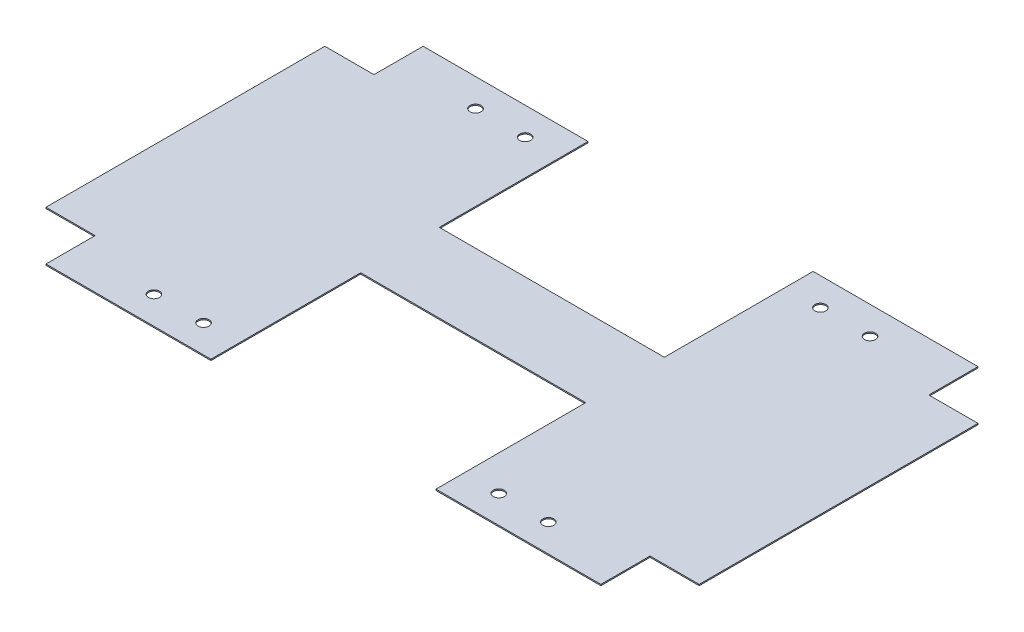
ISO-10303-21;
HEADER;
FILE_DESCRIPTION(('STEP AP214'),'2;1');
FILE_NAME('part.step','',(''),(''),'','','');
FILE_SCHEMA(('AUTOMOTIVE_DESIGN { 1 0 10303 214 1 1 1 1 }'));
ENDSEC;
DATA;
#1=APPLICATION_CONTEXT('core data for automotive mechanical design processes');
#2=APPLICATION_PROTOCOL_DEFINITION('international standard','automotive_design',2000,#1);
#3=PRODUCT_CONTEXT('',#1,'mechanical');
#4=PRODUCT('Part','Part','',(#3));
#5=PRODUCT_RELATED_PRODUCT_CATEGORY('part','',(#4));
#6=PRODUCT_DEFINITION_FORMATION('','',#4);
#7=PRODUCT_DEFINITION_CONTEXT('part definition',#1,'design');
#8=PRODUCT_DEFINITION('design','',#6,#7);
#9=PRODUCT_DEFINITION_SHAPE('','',#8);
#10=(LENGTH_UNIT() NAMED_UNIT(*) SI_UNIT(.MILLI.,.METRE.));
#11=(NAMED_UNIT(*) PLANE_ANGLE_UNIT() SI_UNIT($,.RADIAN.));
#12=(NAMED_UNIT(*) SI_UNIT($,.STERADIAN.) SOLID_ANGLE_UNIT());
#13=UNCERTAINTY_MEASURE_WITH_UNIT(LENGTH_MEASURE(1.E-05),#10,'distance_accuracy_value','');
#14=(GEOMETRIC_REPRESENTATION_CONTEXT(3) GLOBAL_UNCERTAINTY_ASSIGNED_CONTEXT((#13)) GLOBAL_UNIT_ASSIGNED_CONTEXT((#10,
#11,#12)) REPRESENTATION_CONTEXT('',''));
#15=CARTESIAN_POINT('',(0.,0.,0.));
#16=DIRECTION('',(0.,0.,1.));
#17=DIRECTION('',(1.,0.,0.));
#18=AXIS2_PLACEMENT_3D('',#15,#16,#17);
#19=CARTESIAN_POINT('',(-22.9,0.25,-38.37));
#20=DIRECTION('',(0.,-1.,0.));
#21=DIRECTION('',(0.,0.,-1.));
#22=AXIS2_PLACEMENT_3D('',#19,#20,#21);
#23=PLANE('',#22);
#24=CARTESIAN_POINT('',(-30.04,0.25,32.73));
#25=DIRECTION('',(0.,1.,0.));
#26=DIRECTION('',(0.,0.,1.));
#27=AXIS2_PLACEMENT_3D('',#24,#25,#26);
#28=CIRCLE('',#27,1.125);
#29=CARTESIAN_POINT('',(-30.04,0.25,33.855));
#30=VERTEX_POINT('',#29);
#31=EDGE_CURVE('E410',#30,#30,#28,.T.);
#32=ORIENTED_EDGE('',*,*,#31,.F.);
#33=EDGE_LOOP('',(#32));
#34=FACE_BOUND('',#33,.T.);
#35=CARTESIAN_POINT('',(40.14,0.25,32.73));
#36=DIRECTION('',(0.,1.,0.));
#37=DIRECTION('',(0.,0.,1.));
#38=AXIS2_PLACEMENT_3D('',#35,#36,#37);
#39=CIRCLE('',#38,1.125);
#40=CARTESIAN_POINT('',(40.14,0.25,33.855));
#41=VERTEX_POINT('',#40);
#42=EDGE_CURVE('E422',#41,#41,#39,.T.);
#43=ORIENTED_EDGE('',*,*,#42,.F.);
#44=EDGE_LOOP('',(#43));
#45=FACE_BOUND('',#44,.T.);
#46=CARTESIAN_POINT('',(30.04,0.25,-32.72));
#47=DIRECTION('',(0.,1.,0.));
#48=DIRECTION('',(0.,0.,1.));
#49=AXIS2_PLACEMENT_3D('',#46,#47,#48);
#50=CIRCLE('',#49,1.125);
#51=CARTESIAN_POINT('',(30.04,0.25,-31.595));
#52=VERTEX_POINT('',#51);
#53=EDGE_CURVE('E434',#52,#52,#50,.T.);
#54=ORIENTED_EDGE('',*,*,#53,.F.);
#55=EDGE_LOOP('',(#54));
#56=FACE_BOUND('',#55,.T.);
#57=CARTESIAN_POINT('',(-40.14,0.25,-32.72));
#58=DIRECTION('',(0.,1.,0.));
#59=DIRECTION('',(0.,0.,1.));
#60=AXIS2_PLACEMENT_3D('',#57,#58,#59);
#61=CIRCLE('',#60,1.125);
#62=CARTESIAN_POINT('',(-40.14,0.25,-31.595));
#63=VERTEX_POINT('',#62);
#64=EDGE_CURVE('E204',#63,#63,#61,.T.);
#65=ORIENTED_EDGE('',*,*,#64,.F.);
#66=EDGE_LOOP('',(#65));
#67=FACE_BOUND('',#66,.T.);
#68=DIRECTION('',(-1.,0.,0.));
#69=VECTOR('',#68,1.);
#70=CARTESIAN_POINT('',(-56.46,0.25,-38.37));
#71=LINE('',#70,#69);
#72=CARTESIAN_POINT('',(-22.9,0.25,-38.37));
#73=VERTEX_POINT('',#72);
#74=CARTESIAN_POINT('',(-56.46,0.25,-38.37));
#75=VERTEX_POINT('',#74);
#76=EDGE_CURVE('E239',#73,#75,#71,.T.);
#77=ORIENTED_EDGE('',*,*,#76,.T.);
#78=DIRECTION('',(0.,0.,1.));
#79=VECTOR('',#78,1.);
#80=CARTESIAN_POINT('',(-56.46,0.25,-38.37));
#81=LINE('',#80,#79);
#82=CARTESIAN_POINT('',(-56.46,0.25,-28.37));
#83=VERTEX_POINT('',#82);
#84=EDGE_CURVE('E127',#75,#83,#81,.T.);
#85=ORIENTED_EDGE('',*,*,#84,.T.);
#86=DIRECTION('',(-1.,0.,0.));
#87=VECTOR('',#86,1.);
#88=CARTESIAN_POINT('',(-56.46,0.25,-28.37));
#89=LINE('',#88,#87);
#90=CARTESIAN_POINT('',(-66.46,0.25,-28.37));
#91=VERTEX_POINT('',#90);
#92=EDGE_CURVE('E290',#83,#91,#89,.T.);
#93=ORIENTED_EDGE('',*,*,#92,.T.);
#94=DIRECTION('',(0.,0.,1.));
#95=VECTOR('',#94,1.);
#96=CARTESIAN_POINT('',(-66.46,0.25,-28.37));
#97=LINE('',#96,#95);
#98=CARTESIAN_POINT('',(-66.46,0.25,28.37));
#99=VERTEX_POINT('',#98);
#100=EDGE_CURVE('E309',#91,#99,#97,.T.);
#101=ORIENTED_EDGE('',*,*,#100,.T.);
#102=DIRECTION('',(1.,0.,0.));
#103=VECTOR('',#102,1.);
#104=CARTESIAN_POINT('',(-66.46,0.25,28.37));
#105=LINE('',#104,#103);
#106=CARTESIAN_POINT('',(-56.46,0.25,28.37));
#107=VERTEX_POINT('',#106);
#108=EDGE_CURVE('E306',#99,#107,#105,.T.);
#109=ORIENTED_EDGE('',*,*,#108,.T.);
#110=DIRECTION('',(0.,0.,1.));
#111=VECTOR('',#110,1.);
#112=CARTESIAN_POINT('',(-56.46,0.25,28.37));
#113=LINE('',#112,#111);
#114=CARTESIAN_POINT('',(-56.46,0.25,38.37));
#115=VERTEX_POINT('',#114);
#116=EDGE_CURVE('E308',#107,#115,#113,.T.);
#117=ORIENTED_EDGE('',*,*,#116,.T.);
#118=DIRECTION('',(1.,0.,0.));
#119=VECTOR('',#118,1.);
#120=CARTESIAN_POINT('',(-56.46,0.25,38.37));
#121=LINE('',#120,#119);
#122=CARTESIAN_POINT('',(-22.9,0.25,38.37));
#123=VERTEX_POINT('',#122);
#124=EDGE_CURVE('E311',#115,#123,#121,.T.);
#125=ORIENTED_EDGE('',*,*,#124,.T.);
#126=DIRECTION('',(0.,0.,-1.));
#127=VECTOR('',#126,1.);
#128=CARTESIAN_POINT('',(-22.9,0.25,38.37));
#129=LINE('',#128,#127);
#130=CARTESIAN_POINT('',(-22.9,0.25,7.895));
#131=VERTEX_POINT('',#130);
#132=EDGE_CURVE('E317',#123,#131,#129,.T.);
#133=ORIENTED_EDGE('',*,*,#132,.T.);
#134=DIRECTION('',(1.,0.,0.));
#135=VECTOR('',#134,1.);
#136=CARTESIAN_POINT('',(-22.9,0.25,7.895));
#137=LINE('',#136,#135);
#138=CARTESIAN_POINT('',(22.9,0.25,7.895));
#139=VERTEX_POINT('',#138);
#140=EDGE_CURVE('E319',#131,#139,#137,.T.);
#141=ORIENTED_EDGE('',*,*,#140,.T.);
#142=DIRECTION('',(0.,0.,1.));
#143=VECTOR('',#142,1.);
#144=CARTESIAN_POINT('',(22.9,0.25,7.895));
#145=LINE('',#144,#143);
#146=CARTESIAN_POINT('',(22.9,0.25,38.37));
#147=VERTEX_POINT('',#146);
#148=EDGE_CURVE('E321',#139,#147,#145,.T.);
#149=ORIENTED_EDGE('',*,*,#148,.T.);
#150=DIRECTION('',(1.,0.,0.));
#151=VECTOR('',#150,1.);
#152=CARTESIAN_POINT('',(22.9,0.25,38.37));
#153=LINE('',#152,#151);
#154=CARTESIAN_POINT('',(56.46,0.25,38.37));
#155=VERTEX_POINT('',#154);
#156=EDGE_CURVE('E323',#147,#155,#153,.T.);
#157=ORIENTED_EDGE('',*,*,#156,.T.);
#158=DIRECTION('',(0.,0.,-1.));
#159=VECTOR('',#158,1.);
#160=CARTESIAN_POINT('',(56.46,0.25,28.37));
#161=LINE('',#160,#159);
#162=CARTESIAN_POINT('',(56.46,0.25,28.37));
#163=VERTEX_POINT('',#162);
#164=EDGE_CURVE('E325',#155,#163,#161,.T.);
#165=ORIENTED_EDGE('',*,*,#164,.T.);
#166=DIRECTION('',(1.,0.,0.));
#167=VECTOR('',#166,1.);
#168=CARTESIAN_POINT('',(66.46,0.25,28.37));
#169=LINE('',#168,#167);
#170=CARTESIAN_POINT('',(66.46,0.25,28.37));
#171=VERTEX_POINT('',#170);
#172=EDGE_CURVE('E327',#163,#171,#169,.T.);
#173=ORIENTED_EDGE('',*,*,#172,.T.);
#174=DIRECTION('',(0.,0.,-1.));
#175=VECTOR('',#174,1.);
#176=CARTESIAN_POINT('',(66.46,0.25,-28.37));
#177=LINE('',#176,#175);
#178=CARTESIAN_POINT('',(66.46,0.25,-28.37));
#179=VERTEX_POINT('',#178);
#180=EDGE_CURVE('E329',#171,#179,#177,.T.);
#181=ORIENTED_EDGE('',*,*,#180,.T.);
#182=DIRECTION('',(-1.,0.,0.));
#183=VECTOR('',#182,1.);
#184=CARTESIAN_POINT('',(66.46,0.25,-28.37));
#185=LINE('',#184,#183);
#186=CARTESIAN_POINT('',(56.46,0.25,-28.37));
#187=VERTEX_POINT('',#186);
#188=EDGE_CURVE('E331',#179,#187,#185,.T.);
#189=ORIENTED_EDGE('',*,*,#188,.T.);
#190=DIRECTION('',(0.,0.,-1.));
#191=VECTOR('',#190,1.);
#192=CARTESIAN_POINT('',(56.46,0.25,-28.37));
#193=LINE('',#192,#191);
#194=CARTESIAN_POINT('',(56.46,0.25,-38.37));
#195=VERTEX_POINT('',#194);
#196=EDGE_CURVE('E333',#187,#195,#193,.T.);
#197=ORIENTED_EDGE('',*,*,#196,.T.);
#198=DIRECTION('',(-1.,0.,0.));
#199=VECTOR('',#198,1.);
#200=CARTESIAN_POINT('',(22.9,0.25,-38.37));
#201=LINE('',#200,#199);
#202=CARTESIAN_POINT('',(22.9,0.25,-38.37));
#203=VERTEX_POINT('',#202);
#204=EDGE_CURVE('E182',#195,#203,#201,.T.);
#205=ORIENTED_EDGE('',*,*,#204,.T.);
#206=DIRECTION('',(0.,0.,1.));
#207=VECTOR('',#206,1.);
#208=CARTESIAN_POINT('',(22.9,0.25,-8.10500000000001));
#209=LINE('',#208,#207);
#210=CARTESIAN_POINT('',(22.9,0.25,-8.10500000000001));
#211=VERTEX_POINT('',#210);
#212=EDGE_CURVE('E176',#203,#211,#209,.T.);
#213=ORIENTED_EDGE('',*,*,#212,.T.);
#214=DIRECTION('',(-1.,0.,0.));
#215=VECTOR('',#214,1.);
#216=CARTESIAN_POINT('',(-22.9,0.25,-8.105));
#217=LINE('',#216,#215);
#218=CARTESIAN_POINT('',(-22.9,0.25,-8.105));
#219=VERTEX_POINT('',#218);
#220=EDGE_CURVE('E180',#211,#219,#217,.T.);
#221=ORIENTED_EDGE('',*,*,#220,.T.);
#222=DIRECTION('',(0.,0.,-1.));
#223=VECTOR('',#222,1.);
#224=CARTESIAN_POINT('',(-22.9,0.25,-38.37));
#225=LINE('',#224,#223);
#226=EDGE_CURVE('E48',#219,#73,#225,.T.);
#227=ORIENTED_EDGE('',*,*,#226,.T.);
#228=EDGE_LOOP('',(#77,#85,#93,#101,#109,#117,#125,#133,#141,#149,#157,#165,#173,#181,#189,#197,
#205,#213,#221,#227));
#229=FACE_BOUND('',#228,.T.);
#230=CARTESIAN_POINT('',(-30.04,0.25,-32.72));
#231=DIRECTION('',(0.,1.,0.));
#232=DIRECTION('',(0.,0.,1.));
#233=AXIS2_PLACEMENT_3D('',#230,#231,#232);
#234=CIRCLE('',#233,1.125);
#235=CARTESIAN_POINT('',(-30.04,0.25,-31.595));
#236=VERTEX_POINT('',#235);
#237=EDGE_CURVE('E440',#236,#236,#234,.T.);
#238=ORIENTED_EDGE('',*,*,#237,.F.);
#239=EDGE_LOOP('',(#238));
#240=FACE_BOUND('',#239,.T.);
#241=CARTESIAN_POINT('',(40.14,0.25,-32.72));
#242=DIRECTION('',(0.,1.,0.));
#243=DIRECTION('',(0.,0.,1.));
#244=AXIS2_PLACEMENT_3D('',#241,#242,#243);
#245=CIRCLE('',#244,1.125);
#246=CARTESIAN_POINT('',(40.14,0.25,-31.595));
#247=VERTEX_POINT('',#246);
#248=EDGE_CURVE('E428',#247,#247,#245,.T.);
#249=ORIENTED_EDGE('',*,*,#248,.F.);
#250=EDGE_LOOP('',(#249));
#251=FACE_BOUND('',#250,.T.);
#252=CARTESIAN_POINT('',(30.04,0.25,32.73));
#253=DIRECTION('',(0.,1.,0.));
#254=DIRECTION('',(0.,0.,1.));
#255=AXIS2_PLACEMENT_3D('',#252,#253,#254);
#256=CIRCLE('',#255,1.125);
#257=CARTESIAN_POINT('',(30.04,0.25,33.855));
#258=VERTEX_POINT('',#257);
#259=EDGE_CURVE('E416',#258,#258,#256,.T.);
#260=ORIENTED_EDGE('',*,*,#259,.F.);
#261=EDGE_LOOP('',(#260));
#262=FACE_BOUND('',#261,.T.);
#263=CARTESIAN_POINT('',(-40.14,0.25,32.73));
#264=DIRECTION('',(0.,1.,0.));
#265=DIRECTION('',(0.,0.,1.));
#266=AXIS2_PLACEMENT_3D('',#263,#264,#265);
#267=CIRCLE('',#266,1.125);
#268=CARTESIAN_POINT('',(-40.14,0.25,33.855));
#269=VERTEX_POINT('',#268);
#270=EDGE_CURVE('E401',#269,#269,#267,.T.);
#271=ORIENTED_EDGE('',*,*,#270,.F.);
#272=EDGE_LOOP('',(#271));
#273=FACE_BOUND('',#272,.T.);
#274=ADVANCED_FACE('F31',(#34,#45,#56,#67,#229,#240,#251,#262,#273),#23,.F.);
#275=CARTESIAN_POINT('',(-22.9,0.,-38.37));
#276=DIRECTION('',(0.,-1.,0.));
#277=DIRECTION('',(0.,0.,-1.));
#278=AXIS2_PLACEMENT_3D('',#275,#276,#277);
#279=PLANE('',#278);
#280=CARTESIAN_POINT('',(-30.04,0.,32.73));
#281=DIRECTION('',(0.,1.,0.));
#282=DIRECTION('',(0.,0.,1.));
#283=AXIS2_PLACEMENT_3D('',#280,#281,#282);
#284=CIRCLE('',#283,1.125);
#285=CARTESIAN_POINT('',(-30.04,0.,33.855));
#286=VERTEX_POINT('',#285);
#287=EDGE_CURVE('E407',#286,#286,#284,.T.);
#288=ORIENTED_EDGE('',*,*,#287,.T.);
#289=EDGE_LOOP('',(#288));
#290=FACE_BOUND('',#289,.T.);
#291=CARTESIAN_POINT('',(40.14,0.,32.73));
#292=DIRECTION('',(0.,1.,0.));
#293=DIRECTION('',(0.,0.,1.));
#294=AXIS2_PLACEMENT_3D('',#291,#292,#293);
#295=CIRCLE('',#294,1.125);
#296=CARTESIAN_POINT('',(40.14,0.,33.855));
#297=VERTEX_POINT('',#296);
#298=EDGE_CURVE('E419',#297,#297,#295,.T.);
#299=ORIENTED_EDGE('',*,*,#298,.T.);
#300=EDGE_LOOP('',(#299));
#301=FACE_BOUND('',#300,.T.);
#302=CARTESIAN_POINT('',(30.04,0.,-32.72));
#303=DIRECTION('',(0.,1.,0.));
#304=DIRECTION('',(0.,0.,1.));
#305=AXIS2_PLACEMENT_3D('',#302,#303,#304);
#306=CIRCLE('',#305,1.125);
#307=CARTESIAN_POINT('',(30.04,0.,-31.595));
#308=VERTEX_POINT('',#307);
#309=EDGE_CURVE('E431',#308,#308,#306,.T.);
#310=ORIENTED_EDGE('',*,*,#309,.T.);
#311=EDGE_LOOP('',(#310));
#312=FACE_BOUND('',#311,.T.);
#313=CARTESIAN_POINT('',(-40.14,0.,-32.72));
#314=DIRECTION('',(0.,1.,0.));
#315=DIRECTION('',(0.,0.,1.));
#316=AXIS2_PLACEMENT_3D('',#313,#314,#315);
#317=CIRCLE('',#316,1.125);
#318=CARTESIAN_POINT('',(-40.14,0.,-31.595));
#319=VERTEX_POINT('',#318);
#320=EDGE_CURVE('E443',#319,#319,#317,.T.);
#321=ORIENTED_EDGE('',*,*,#320,.T.);
#322=EDGE_LOOP('',(#321));
#323=FACE_BOUND('',#322,.T.);
#324=DIRECTION('',(-1.,0.,0.));
#325=VECTOR('',#324,1.);
#326=CARTESIAN_POINT('',(-56.46,0.,-38.37));
#327=LINE('',#326,#325);
#328=CARTESIAN_POINT('',(-22.9,0.,-38.37));
#329=VERTEX_POINT('',#328);
#330=CARTESIAN_POINT('',(-56.46,0.,-38.37));
#331=VERTEX_POINT('',#330);
#332=EDGE_CURVE('E200',#329,#331,#327,.T.);
#333=ORIENTED_EDGE('',*,*,#332,.F.);
#334=DIRECTION('',(0.,0.,-1.));
#335=VECTOR('',#334,1.);
#336=CARTESIAN_POINT('',(-22.9,0.,-38.37));
#337=LINE('',#336,#335);
#338=CARTESIAN_POINT('',(-22.9,0.,-8.105));
#339=VERTEX_POINT('',#338);
#340=EDGE_CURVE('E119',#339,#329,#337,.T.);
#341=ORIENTED_EDGE('',*,*,#340,.F.);
#342=DIRECTION('',(-1.,0.,0.));
#343=VECTOR('',#342,1.);
#344=CARTESIAN_POINT('',(-22.9,0.,-8.105));
#345=LINE('',#344,#343);
#346=CARTESIAN_POINT('',(22.9,0.,-8.10500000000001));
#347=VERTEX_POINT('',#346);
#348=EDGE_CURVE('E113',#347,#339,#345,.T.);
#349=ORIENTED_EDGE('',*,*,#348,.F.);
#350=DIRECTION('',(0.,0.,1.));
#351=VECTOR('',#350,1.);
#352=CARTESIAN_POINT('',(22.9,0.,-8.10500000000001));
#353=LINE('',#352,#351);
#354=CARTESIAN_POINT('',(22.9,0.,-38.37));
#355=VERTEX_POINT('',#354);
#356=EDGE_CURVE('E190',#355,#347,#353,.T.);
#357=ORIENTED_EDGE('',*,*,#356,.F.);
#358=DIRECTION('',(-1.,0.,0.));
#359=VECTOR('',#358,1.);
#360=CARTESIAN_POINT('',(22.9,0.,-38.37));
#361=LINE('',#360,#359);
#362=CARTESIAN_POINT('',(56.46,0.,-38.37));
#363=VERTEX_POINT('',#362);
#364=EDGE_CURVE('E234',#363,#355,#361,.T.);
#365=ORIENTED_EDGE('',*,*,#364,.F.);
#366=DIRECTION('',(0.,0.,-1.));
#367=VECTOR('',#366,1.);
#368=CARTESIAN_POINT('',(56.46,0.,-28.37));
#369=LINE('',#368,#367);
#370=CARTESIAN_POINT('',(56.46,0.,-28.37));
#371=VERTEX_POINT('',#370);
#372=EDGE_CURVE('E232',#371,#363,#369,.T.);
#373=ORIENTED_EDGE('',*,*,#372,.F.);
#374=DIRECTION('',(-1.,0.,0.));
#375=VECTOR('',#374,1.);
#376=CARTESIAN_POINT('',(66.46,0.,-28.37));
#377=LINE('',#376,#375);
#378=CARTESIAN_POINT('',(66.46,0.,-28.37));
#379=VERTEX_POINT('',#378);
#380=EDGE_CURVE('E230',#379,#371,#377,.T.);
#381=ORIENTED_EDGE('',*,*,#380,.F.);
#382=DIRECTION('',(0.,0.,-1.));
#383=VECTOR('',#382,1.);
#384=CARTESIAN_POINT('',(66.46,0.,-28.37));
#385=LINE('',#384,#383);
#386=CARTESIAN_POINT('',(66.46,0.,28.37));
#387=VERTEX_POINT('',#386);
#388=EDGE_CURVE('E228',#387,#379,#385,.T.);
#389=ORIENTED_EDGE('',*,*,#388,.F.);
#390=DIRECTION('',(1.,0.,0.));
#391=VECTOR('',#390,1.);
#392=CARTESIAN_POINT('',(66.46,0.,28.37));
#393=LINE('',#392,#391);
#394=CARTESIAN_POINT('',(56.46,0.,28.37));
#395=VERTEX_POINT('',#394);
#396=EDGE_CURVE('E226',#395,#387,#393,.T.);
#397=ORIENTED_EDGE('',*,*,#396,.F.);
#398=DIRECTION('',(0.,0.,-1.));
#399=VECTOR('',#398,1.);
#400=CARTESIAN_POINT('',(56.46,0.,28.37));
#401=LINE('',#400,#399);
#402=CARTESIAN_POINT('',(56.46,0.,38.37));
#403=VERTEX_POINT('',#402);
#404=EDGE_CURVE('E224',#403,#395,#401,.T.);
#405=ORIENTED_EDGE('',*,*,#404,.F.);
#406=DIRECTION('',(1.,0.,0.));
#407=VECTOR('',#406,1.);
#408=CARTESIAN_POINT('',(22.9,0.,38.37));
#409=LINE('',#408,#407);
#410=CARTESIAN_POINT('',(22.9,0.,38.37));
#411=VERTEX_POINT('',#410);
#412=EDGE_CURVE('E222',#411,#403,#409,.T.);
#413=ORIENTED_EDGE('',*,*,#412,.F.);
#414=DIRECTION('',(0.,0.,1.));
#415=VECTOR('',#414,1.);
#416=CARTESIAN_POINT('',(22.9,0.,7.895));
#417=LINE('',#416,#415);
#418=CARTESIAN_POINT('',(22.9,0.,7.895));
#419=VERTEX_POINT('',#418);
#420=EDGE_CURVE('E220',#419,#411,#417,.T.);
#421=ORIENTED_EDGE('',*,*,#420,.F.);
#422=DIRECTION('',(1.,0.,0.));
#423=VECTOR('',#422,1.);
#424=CARTESIAN_POINT('',(-22.9,0.,7.895));
#425=LINE('',#424,#423);
#426=CARTESIAN_POINT('',(-22.9,0.,7.895));
#427=VERTEX_POINT('',#426);
#428=EDGE_CURVE('E218',#427,#419,#425,.T.);
#429=ORIENTED_EDGE('',*,*,#428,.F.);
#430=DIRECTION('',(0.,0.,-1.));
#431=VECTOR('',#430,1.);
#432=CARTESIAN_POINT('',(-22.9,0.,38.37));
#433=LINE('',#432,#431);
#434=CARTESIAN_POINT('',(-22.9,0.,38.37));
#435=VERTEX_POINT('',#434);
#436=EDGE_CURVE('E216',#435,#427,#433,.T.);
#437=ORIENTED_EDGE('',*,*,#436,.F.);
#438=DIRECTION('',(1.,0.,0.));
#439=VECTOR('',#438,1.);
#440=CARTESIAN_POINT('',(-56.46,0.,38.37));
#441=LINE('',#440,#439);
#442=CARTESIAN_POINT('',(-56.46,0.,38.37));
#443=VERTEX_POINT('',#442);
#444=EDGE_CURVE('E214',#443,#435,#441,.T.);
#445=ORIENTED_EDGE('',*,*,#444,.F.);
#446=DIRECTION('',(0.,0.,1.));
#447=VECTOR('',#446,1.);
#448=CARTESIAN_POINT('',(-56.46,0.,28.37));
#449=LINE('',#448,#447);
#450=CARTESIAN_POINT('',(-56.46,0.,28.37));
#451=VERTEX_POINT('',#450);
#452=EDGE_CURVE('E212',#451,#443,#449,.T.);
#453=ORIENTED_EDGE('',*,*,#452,.F.);
#454=DIRECTION('',(1.,0.,0.));
#455=VECTOR('',#454,1.);
#456=CARTESIAN_POINT('',(-66.46,0.,28.37));
#457=LINE('',#456,#455);
#458=CARTESIAN_POINT('',(-66.46,0.,28.37));
#459=VERTEX_POINT('',#458);
#460=EDGE_CURVE('E210',#459,#451,#457,.T.);
#461=ORIENTED_EDGE('',*,*,#460,.F.);
#462=DIRECTION('',(0.,0.,1.));
#463=VECTOR('',#462,1.);
#464=CARTESIAN_POINT('',(-66.46,0.,-28.37));
#465=LINE('',#464,#463);
#466=CARTESIAN_POINT('',(-66.46,0.,-28.37));
#467=VERTEX_POINT('',#466);
#468=EDGE_CURVE('E208',#467,#459,#465,.T.);
#469=ORIENTED_EDGE('',*,*,#468,.F.);
#470=DIRECTION('',(-1.,0.,0.));
#471=VECTOR('',#470,1.);
#472=CARTESIAN_POINT('',(-56.46,0.,-28.37));
#473=LINE('',#472,#471);
#474=CARTESIAN_POINT('',(-56.46,0.,-28.37));
#475=VERTEX_POINT('',#474);
#476=EDGE_CURVE('E206',#475,#467,#473,.T.);
#477=ORIENTED_EDGE('',*,*,#476,.F.);
#478=DIRECTION('',(0.,0.,1.));
#479=VECTOR('',#478,1.);
#480=CARTESIAN_POINT('',(-56.46,0.,-38.37));
#481=LINE('',#480,#479);
#482=EDGE_CURVE('E203',#331,#475,#481,.T.);
#483=ORIENTED_EDGE('',*,*,#482,.F.);
#484=EDGE_LOOP('',(#333,#341,#349,#357,#365,#373,#381,#389,#397,#405,#413,#421,#429,#437,#445,
#453,#461,#469,#477,#483));
#485=FACE_BOUND('',#484,.T.);
#486=CARTESIAN_POINT('',(-30.04,0.,-32.72));
#487=DIRECTION('',(0.,1.,0.));
#488=DIRECTION('',(0.,0.,1.));
#489=AXIS2_PLACEMENT_3D('',#486,#487,#488);
#490=CIRCLE('',#489,1.125);
#491=CARTESIAN_POINT('',(-30.04,0.,-31.595));
#492=VERTEX_POINT('',#491);
#493=EDGE_CURVE('E437',#492,#492,#490,.T.);
#494=ORIENTED_EDGE('',*,*,#493,.T.);
#495=EDGE_LOOP('',(#494));
#496=FACE_BOUND('',#495,.T.);
#497=CARTESIAN_POINT('',(40.14,0.,-32.72));
#498=DIRECTION('',(0.,1.,0.));
#499=DIRECTION('',(0.,0.,1.));
#500=AXIS2_PLACEMENT_3D('',#497,#498,#499);
#501=CIRCLE('',#500,1.125);
#502=CARTESIAN_POINT('',(40.14,0.,-31.595));
#503=VERTEX_POINT('',#502);
#504=EDGE_CURVE('E425',#503,#503,#501,.T.);
#505=ORIENTED_EDGE('',*,*,#504,.T.);
#506=EDGE_LOOP('',(#505));
#507=FACE_BOUND('',#506,.T.);
#508=CARTESIAN_POINT('',(30.04,0.,32.73));
#509=DIRECTION('',(0.,1.,0.));
#510=DIRECTION('',(0.,0.,1.));
#511=AXIS2_PLACEMENT_3D('',#508,#509,#510);
#512=CIRCLE('',#511,1.125);
#513=CARTESIAN_POINT('',(30.04,0.,33.855));
#514=VERTEX_POINT('',#513);
#515=EDGE_CURVE('E413',#514,#514,#512,.T.);
#516=ORIENTED_EDGE('',*,*,#515,.T.);
#517=EDGE_LOOP('',(#516));
#518=FACE_BOUND('',#517,.T.);
#519=CARTESIAN_POINT('',(-40.14,0.,32.73));
#520=DIRECTION('',(0.,1.,0.));
#521=DIRECTION('',(0.,0.,1.));
#522=AXIS2_PLACEMENT_3D('',#519,#520,#521);
#523=CIRCLE('',#522,1.125);
#524=CARTESIAN_POINT('',(-40.14,0.,33.855));
#525=VERTEX_POINT('',#524);
#526=EDGE_CURVE('E404',#525,#525,#523,.T.);
#527=ORIENTED_EDGE('',*,*,#526,.T.);
#528=EDGE_LOOP('',(#527));
#529=FACE_BOUND('',#528,.T.);
#530=ADVANCED_FACE('F294',(#290,#301,#312,#323,#485,#496,#507,#518,#529),#279,.T.);
#531=CARTESIAN_POINT('',(-56.46,0.25,-38.37));
#532=DIRECTION('',(0.,0.,1.));
#533=DIRECTION('',(1.,0.,0.));
#534=AXIS2_PLACEMENT_3D('',#531,#532,#533);
#535=PLANE('',#534);
#536=ORIENTED_EDGE('',*,*,#332,.T.);
#537=DIRECTION('',(0.,-1.,0.));
#538=VECTOR('',#537,1.);
#539=CARTESIAN_POINT('',(-56.46,0.25,-38.37));
#540=LINE('',#539,#538);
#541=EDGE_CURVE('E11',#75,#331,#540,.T.);
#542=ORIENTED_EDGE('',*,*,#541,.F.);
#543=ORIENTED_EDGE('',*,*,#76,.F.);
#544=DIRECTION('',(0.,-1.,0.));
#545=VECTOR('',#544,1.);
#546=CARTESIAN_POINT('',(-22.9,0.25,-38.37));
#547=LINE('',#546,#545);
#548=EDGE_CURVE('E196',#73,#329,#547,.T.);
#549=ORIENTED_EDGE('',*,*,#548,.T.);
#550=EDGE_LOOP('',(#536,#542,#543,#549));
#551=FACE_BOUND('',#550,.T.);
#552=ADVANCED_FACE('F33',(#551),#535,.F.);
#553=CARTESIAN_POINT('',(-56.46,0.25,-38.37));
#554=DIRECTION('',(1.,0.,0.));
#555=DIRECTION('',(0.,0.,-1.));
#556=AXIS2_PLACEMENT_3D('',#553,#554,#555);
#557=PLANE('',#556);
#558=ORIENTED_EDGE('',*,*,#482,.T.);
#559=DIRECTION('',(0.,-1.,0.));
#560=VECTOR('',#559,1.);
#561=CARTESIAN_POINT('',(-56.46,0.25,-28.37));
#562=LINE('',#561,#560);
#563=EDGE_CURVE('E40',#83,#475,#562,.T.);
#564=ORIENTED_EDGE('',*,*,#563,.F.);
#565=ORIENTED_EDGE('',*,*,#84,.F.);
#566=ORIENTED_EDGE('',*,*,#541,.T.);
#567=EDGE_LOOP('',(#558,#564,#565,#566));
#568=FACE_BOUND('',#567,.T.);
#569=ADVANCED_FACE('F668',(#568),#557,.F.);
#570=CARTESIAN_POINT('',(-56.46,0.25,-28.37));
#571=DIRECTION('',(0.,0.,1.));
#572=DIRECTION('',(1.,0.,0.));
#573=AXIS2_PLACEMENT_3D('',#570,#571,#572);
#574=PLANE('',#573);
#575=ORIENTED_EDGE('',*,*,#476,.T.);
#576=DIRECTION('',(0.,-1.,0.));
#577=VECTOR('',#576,1.);
#578=CARTESIAN_POINT('',(-66.46,0.25,-28.37));
#579=LINE('',#578,#577);
#580=EDGE_CURVE('E282',#91,#467,#579,.T.);
#581=ORIENTED_EDGE('',*,*,#580,.F.);
#582=ORIENTED_EDGE('',*,*,#92,.F.);
#583=ORIENTED_EDGE('',*,*,#563,.T.);
#584=EDGE_LOOP('',(#575,#581,#582,#583));
#585=FACE_BOUND('',#584,.T.);
#586=ADVANCED_FACE('F288',(#585),#574,.F.);
#587=CARTESIAN_POINT('',(-66.46,0.25,-28.37));
#588=DIRECTION('',(1.,0.,0.));
#589=DIRECTION('',(0.,0.,-1.));
#590=AXIS2_PLACEMENT_3D('',#587,#588,#589);
#591=PLANE('',#590);
#592=ORIENTED_EDGE('',*,*,#468,.T.);
#593=DIRECTION('',(0.,-1.,0.));
#594=VECTOR('',#593,1.);
#595=CARTESIAN_POINT('',(-66.46,0.25,28.37));
#596=LINE('',#595,#594);
#597=EDGE_CURVE('E279',#99,#459,#596,.T.);
#598=ORIENTED_EDGE('',*,*,#597,.F.);
#599=ORIENTED_EDGE('',*,*,#100,.F.);
#600=ORIENTED_EDGE('',*,*,#580,.T.);
#601=EDGE_LOOP('',(#592,#598,#599,#600));
#602=FACE_BOUND('',#601,.T.);
#603=ADVANCED_FACE('F300',(#602),#591,.F.);
#604=CARTESIAN_POINT('',(-66.46,0.25,28.37));
#605=DIRECTION('',(0.,0.,-1.));
#606=DIRECTION('',(-1.,0.,0.));
#607=AXIS2_PLACEMENT_3D('',#604,#605,#606);
#608=PLANE('',#607);
#609=ORIENTED_EDGE('',*,*,#460,.T.);
#610=DIRECTION('',(0.,-1.,0.));
#611=VECTOR('',#610,1.);
#612=CARTESIAN_POINT('',(-56.46,0.25,28.37));
#613=LINE('',#612,#611);
#614=EDGE_CURVE('E276',#107,#451,#613,.T.);
#615=ORIENTED_EDGE('',*,*,#614,.F.);
#616=ORIENTED_EDGE('',*,*,#108,.F.);
#617=ORIENTED_EDGE('',*,*,#597,.T.);
#618=EDGE_LOOP('',(#609,#615,#616,#617));
#619=FACE_BOUND('',#618,.T.);
#620=ADVANCED_FACE('F304',(#619),#608,.F.);
#621=CARTESIAN_POINT('',(-56.46,0.25,28.37));
#622=DIRECTION('',(1.,0.,0.));
#623=DIRECTION('',(0.,0.,-1.));
#624=AXIS2_PLACEMENT_3D('',#621,#622,#623);
#625=PLANE('',#624);
#626=ORIENTED_EDGE('',*,*,#452,.T.);
#627=DIRECTION('',(0.,-1.,0.));
#628=VECTOR('',#627,1.);
#629=CARTESIAN_POINT('',(-56.46,0.25,38.37));
#630=LINE('',#629,#628);
#631=EDGE_CURVE('E273',#115,#443,#630,.T.);
#632=ORIENTED_EDGE('',*,*,#631,.F.);
#633=ORIENTED_EDGE('',*,*,#116,.F.);
#634=ORIENTED_EDGE('',*,*,#614,.T.);
#635=EDGE_LOOP('',(#626,#632,#633,#634));
#636=FACE_BOUND('',#635,.T.);
#637=ADVANCED_FACE('F633',(#636),#625,.F.);
#638=CARTESIAN_POINT('',(-56.46,0.25,38.37));
#639=DIRECTION('',(0.,0.,-1.));
#640=DIRECTION('',(-1.,0.,0.));
#641=AXIS2_PLACEMENT_3D('',#638,#639,#640);
#642=PLANE('',#641);
#643=ORIENTED_EDGE('',*,*,#444,.T.);
#644=DIRECTION('',(0.,-1.,0.));
#645=VECTOR('',#644,1.);
#646=CARTESIAN_POINT('',(-22.9,0.25,38.37));
#647=LINE('',#646,#645);
#648=EDGE_CURVE('E270',#123,#435,#647,.T.);
#649=ORIENTED_EDGE('',*,*,#648,.F.);
#650=ORIENTED_EDGE('',*,*,#124,.F.);
#651=ORIENTED_EDGE('',*,*,#631,.T.);
#652=EDGE_LOOP('',(#643,#649,#650,#651));
#653=FACE_BOUND('',#652,.T.);
#654=ADVANCED_FACE('F623',(#653),#642,.F.);
#655=CARTESIAN_POINT('',(-22.9,0.25,38.37));
#656=DIRECTION('',(-1.,0.,0.));
#657=DIRECTION('',(0.,0.,1.));
#658=AXIS2_PLACEMENT_3D('',#655,#656,#657);
#659=PLANE('',#658);
#660=ORIENTED_EDGE('',*,*,#436,.T.);
#661=DIRECTION('',(0.,-1.,0.));
#662=VECTOR('',#661,1.);
#663=CARTESIAN_POINT('',(-22.9,0.25,7.895));
#664=LINE('',#663,#662);
#665=EDGE_CURVE('E267',#131,#427,#664,.T.);
#666=ORIENTED_EDGE('',*,*,#665,.F.);
#667=ORIENTED_EDGE('',*,*,#132,.F.);
#668=ORIENTED_EDGE('',*,*,#648,.T.);
#669=EDGE_LOOP('',(#660,#666,#667,#668));
#670=FACE_BOUND('',#669,.T.);
#671=ADVANCED_FACE('F613',(#670),#659,.F.);
#672=CARTESIAN_POINT('',(-22.9,0.25,7.895));
#673=DIRECTION('',(0.,0.,-1.));
#674=DIRECTION('',(-1.,0.,0.));
#675=AXIS2_PLACEMENT_3D('',#672,#673,#674);
#676=PLANE('',#675);
#677=ORIENTED_EDGE('',*,*,#428,.T.);
#678=DIRECTION('',(0.,-1.,0.));
#679=VECTOR('',#678,1.);
#680=CARTESIAN_POINT('',(22.9,0.25,7.895));
#681=LINE('',#680,#679);
#682=EDGE_CURVE('E264',#139,#419,#681,.T.);
#683=ORIENTED_EDGE('',*,*,#682,.F.);
#684=ORIENTED_EDGE('',*,*,#140,.F.);
#685=ORIENTED_EDGE('',*,*,#665,.T.);
#686=EDGE_LOOP('',(#677,#683,#684,#685));
#687=FACE_BOUND('',#686,.T.);
#688=ADVANCED_FACE('F603',(#687),#676,.F.);
#689=CARTESIAN_POINT('',(22.9,0.25,7.895));
#690=DIRECTION('',(1.,0.,0.));
#691=DIRECTION('',(0.,0.,-1.));
#692=AXIS2_PLACEMENT_3D('',#689,#690,#691);
#693=PLANE('',#692);
#694=ORIENTED_EDGE('',*,*,#420,.T.);
#695=DIRECTION('',(0.,-1.,0.));
#696=VECTOR('',#695,1.);
#697=CARTESIAN_POINT('',(22.9,0.25,38.37));
#698=LINE('',#697,#696);
#699=EDGE_CURVE('E261',#147,#411,#698,.T.);
#700=ORIENTED_EDGE('',*,*,#699,.F.);
#701=ORIENTED_EDGE('',*,*,#148,.F.);
#702=ORIENTED_EDGE('',*,*,#682,.T.);
#703=EDGE_LOOP('',(#694,#700,#701,#702));
#704=FACE_BOUND('',#703,.T.);
#705=ADVANCED_FACE('F593',(#704),#693,.F.);
#706=CARTESIAN_POINT('',(22.9,0.25,38.37));
#707=DIRECTION('',(0.,0.,-1.));
#708=DIRECTION('',(-1.,0.,0.));
#709=AXIS2_PLACEMENT_3D('',#706,#707,#708);
#710=PLANE('',#709);
#711=ORIENTED_EDGE('',*,*,#412,.T.);
#712=DIRECTION('',(0.,-1.,0.));
#713=VECTOR('',#712,1.);
#714=CARTESIAN_POINT('',(56.46,0.25,38.37));
#715=LINE('',#714,#713);
#716=EDGE_CURVE('E258',#155,#403,#715,.T.);
#717=ORIENTED_EDGE('',*,*,#716,.F.);
#718=ORIENTED_EDGE('',*,*,#156,.F.);
#719=ORIENTED_EDGE('',*,*,#699,.T.);
#720=EDGE_LOOP('',(#711,#717,#718,#719));
#721=FACE_BOUND('',#720,.T.);
#722=ADVANCED_FACE('F583',(#721),#710,.F.);
#723=CARTESIAN_POINT('',(56.46,0.25,28.37));
#724=DIRECTION('',(-1.,0.,0.));
#725=DIRECTION('',(0.,0.,1.));
#726=AXIS2_PLACEMENT_3D('',#723,#724,#725);
#727=PLANE('',#726);
#728=ORIENTED_EDGE('',*,*,#404,.T.);
#729=DIRECTION('',(0.,-1.,0.));
#730=VECTOR('',#729,1.);
#731=CARTESIAN_POINT('',(56.46,0.25,28.37));
#732=LINE('',#731,#730);
#733=EDGE_CURVE('E255',#163,#395,#732,.T.);
#734=ORIENTED_EDGE('',*,*,#733,.F.);
#735=ORIENTED_EDGE('',*,*,#164,.F.);
#736=ORIENTED_EDGE('',*,*,#716,.T.);
#737=EDGE_LOOP('',(#728,#734,#735,#736));
#738=FACE_BOUND('',#737,.T.);
#739=ADVANCED_FACE('F573',(#738),#727,.F.);
#740=CARTESIAN_POINT('',(66.46,0.25,28.37));
#741=DIRECTION('',(0.,0.,-1.));
#742=DIRECTION('',(-1.,0.,0.));
#743=AXIS2_PLACEMENT_3D('',#740,#741,#742);
#744=PLANE('',#743);
#745=ORIENTED_EDGE('',*,*,#396,.T.);
#746=DIRECTION('',(0.,-1.,0.));
#747=VECTOR('',#746,1.);
#748=CARTESIAN_POINT('',(66.46,0.25,28.37));
#749=LINE('',#748,#747);
#750=EDGE_CURVE('E252',#171,#387,#749,.T.);
#751=ORIENTED_EDGE('',*,*,#750,.F.);
#752=ORIENTED_EDGE('',*,*,#172,.F.);
#753=ORIENTED_EDGE('',*,*,#733,.T.);
#754=EDGE_LOOP('',(#745,#751,#752,#753));
#755=FACE_BOUND('',#754,.T.);
#756=ADVANCED_FACE('F563',(#755),#744,.F.);
#757=CARTESIAN_POINT('',(66.46,0.25,-28.37));
#758=DIRECTION('',(-1.,0.,0.));
#759=DIRECTION('',(0.,0.,1.));
#760=AXIS2_PLACEMENT_3D('',#757,#758,#759);
#761=PLANE('',#760);
#762=ORIENTED_EDGE('',*,*,#388,.T.);
#763=DIRECTION('',(0.,-1.,0.));
#764=VECTOR('',#763,1.);
#765=CARTESIAN_POINT('',(66.46,0.25,-28.37));
#766=LINE('',#765,#764);
#767=EDGE_CURVE('E249',#179,#379,#766,.T.);
#768=ORIENTED_EDGE('',*,*,#767,.F.);
#769=ORIENTED_EDGE('',*,*,#180,.F.);
#770=ORIENTED_EDGE('',*,*,#750,.T.);
#771=EDGE_LOOP('',(#762,#768,#769,#770));
#772=FACE_BOUND('',#771,.T.);
#773=ADVANCED_FACE('F553',(#772),#761,.F.);
#774=CARTESIAN_POINT('',(66.46,0.25,-28.37));
#775=DIRECTION('',(0.,0.,1.));
#776=DIRECTION('',(1.,0.,0.));
#777=AXIS2_PLACEMENT_3D('',#774,#775,#776);
#778=PLANE('',#777);
#779=ORIENTED_EDGE('',*,*,#380,.T.);
#780=DIRECTION('',(0.,-1.,0.));
#781=VECTOR('',#780,1.);
#782=CARTESIAN_POINT('',(56.46,0.25,-28.37));
#783=LINE('',#782,#781);
#784=EDGE_CURVE('E246',#187,#371,#783,.T.);
#785=ORIENTED_EDGE('',*,*,#784,.F.);
#786=ORIENTED_EDGE('',*,*,#188,.F.);
#787=ORIENTED_EDGE('',*,*,#767,.T.);
#788=EDGE_LOOP('',(#779,#785,#786,#787));
#789=FACE_BOUND('',#788,.T.);
#790=ADVANCED_FACE('F544',(#789),#778,.F.);
#791=CARTESIAN_POINT('',(56.46,0.25,-28.37));
#792=DIRECTION('',(-1.,0.,0.));
#793=DIRECTION('',(0.,0.,1.));
#794=AXIS2_PLACEMENT_3D('',#791,#792,#793);
#795=PLANE('',#794);
#796=ORIENTED_EDGE('',*,*,#372,.T.);
#797=DIRECTION('',(0.,-1.,0.));
#798=VECTOR('',#797,1.);
#799=CARTESIAN_POINT('',(56.46,0.25,-38.37));
#800=LINE('',#799,#798);
#801=EDGE_CURVE('E243',#195,#363,#800,.T.);
#802=ORIENTED_EDGE('',*,*,#801,.F.);
#803=ORIENTED_EDGE('',*,*,#196,.F.);
#804=ORIENTED_EDGE('',*,*,#784,.T.);
#805=EDGE_LOOP('',(#796,#802,#803,#804));
#806=FACE_BOUND('',#805,.T.);
#807=ADVANCED_FACE('F339',(#806),#795,.F.);
#808=CARTESIAN_POINT('',(22.9,0.25,-38.37));
#809=DIRECTION('',(0.,0.,1.));
#810=DIRECTION('',(1.,0.,0.));
#811=AXIS2_PLACEMENT_3D('',#808,#809,#810);
#812=PLANE('',#811);
#813=ORIENTED_EDGE('',*,*,#364,.T.);
#814=DIRECTION('',(0.,-1.,0.));
#815=VECTOR('',#814,1.);
#816=CARTESIAN_POINT('',(22.9,0.25,-38.37));
#817=LINE('',#816,#815);
#818=EDGE_CURVE('E191',#203,#355,#817,.T.);
#819=ORIENTED_EDGE('',*,*,#818,.F.);
#820=ORIENTED_EDGE('',*,*,#204,.F.);
#821=ORIENTED_EDGE('',*,*,#801,.T.);
#822=EDGE_LOOP('',(#813,#819,#820,#821));
#823=FACE_BOUND('',#822,.T.);
#824=ADVANCED_FACE('F343',(#823),#812,.F.);
#825=CARTESIAN_POINT('',(22.9,0.25,-8.10500000000001));
#826=DIRECTION('',(1.,0.,0.));
#827=DIRECTION('',(0.,0.,-1.));
#828=AXIS2_PLACEMENT_3D('',#825,#826,#827);
#829=PLANE('',#828);
#830=ORIENTED_EDGE('',*,*,#356,.T.);
#831=DIRECTION('',(0.,-1.,0.));
#832=VECTOR('',#831,1.);
#833=CARTESIAN_POINT('',(22.9,0.25,-8.10500000000001));
#834=LINE('',#833,#832);
#835=EDGE_CURVE('E187',#211,#347,#834,.T.);
#836=ORIENTED_EDGE('',*,*,#835,.F.);
#837=ORIENTED_EDGE('',*,*,#212,.F.);
#838=ORIENTED_EDGE('',*,*,#818,.T.);
#839=EDGE_LOOP('',(#830,#836,#837,#838));
#840=FACE_BOUND('',#839,.T.);
#841=ADVANCED_FACE('F188',(#840),#829,.F.);
#842=CARTESIAN_POINT('',(-22.9,0.25,-8.105));
#843=DIRECTION('',(0.,0.,1.));
#844=DIRECTION('',(1.,0.,0.));
#845=AXIS2_PLACEMENT_3D('',#842,#843,#844);
#846=PLANE('',#845);
#847=ORIENTED_EDGE('',*,*,#348,.T.);
#848=DIRECTION('',(0.,-1.,0.));
#849=VECTOR('',#848,1.);
#850=CARTESIAN_POINT('',(-22.9,0.25,-8.105));
#851=LINE('',#850,#849);
#852=EDGE_CURVE('E192',#219,#339,#851,.T.);
#853=ORIENTED_EDGE('',*,*,#852,.F.);
#854=ORIENTED_EDGE('',*,*,#220,.F.);
#855=ORIENTED_EDGE('',*,*,#835,.T.);
#856=EDGE_LOOP('',(#847,#853,#854,#855));
#857=FACE_BOUND('',#856,.T.);
#858=ADVANCED_FACE('F194',(#857),#846,.F.);
#859=CARTESIAN_POINT('',(-22.9,0.25,-38.37));
#860=DIRECTION('',(-1.,0.,0.));
#861=DIRECTION('',(0.,0.,1.));
#862=AXIS2_PLACEMENT_3D('',#859,#860,#861);
#863=PLANE('',#862);
#864=ORIENTED_EDGE('',*,*,#340,.T.);
#865=ORIENTED_EDGE('',*,*,#548,.F.);
#866=ORIENTED_EDGE('',*,*,#226,.F.);
#867=ORIENTED_EDGE('',*,*,#852,.T.);
#868=EDGE_LOOP('',(#864,#865,#866,#867));
#869=FACE_BOUND('',#868,.T.);
#870=ADVANCED_FACE('F347',(#869),#863,.F.);
#871=CARTESIAN_POINT('',(-40.14,0.25,-32.72));
#872=DIRECTION('',(0.,-1.,0.));
#873=DIRECTION('',(0.,0.,-1.));
#874=AXIS2_PLACEMENT_3D('',#871,#872,#873);
#875=CYLINDRICAL_SURFACE('',#874,1.125);
#876=ORIENTED_EDGE('',*,*,#64,.T.);
#877=EDGE_LOOP('',(#876));
#878=FACE_BOUND('',#877,.T.);
#879=ORIENTED_EDGE('',*,*,#320,.F.);
#880=EDGE_LOOP('',(#879));
#881=FACE_BOUND('',#880,.T.);
#882=ADVANCED_FACE('F349',(#878,#881),#875,.F.);
#883=CARTESIAN_POINT('',(-30.04,0.25,-32.72));
#884=DIRECTION('',(0.,-1.,0.));
#885=DIRECTION('',(0.,0.,-1.));
#886=AXIS2_PLACEMENT_3D('',#883,#884,#885);
#887=CYLINDRICAL_SURFACE('',#886,1.125);
#888=ORIENTED_EDGE('',*,*,#237,.T.);
#889=EDGE_LOOP('',(#888));
#890=FACE_BOUND('',#889,.T.);
#891=ORIENTED_EDGE('',*,*,#493,.F.);
#892=EDGE_LOOP('',(#891));
#893=FACE_BOUND('',#892,.T.);
#894=ADVANCED_FACE('F355',(#890,#893),#887,.F.);
#895=CARTESIAN_POINT('',(30.04,0.25,-32.72));
#896=DIRECTION('',(0.,-1.,0.));
#897=DIRECTION('',(0.,0.,-1.));
#898=AXIS2_PLACEMENT_3D('',#895,#896,#897);
#899=CYLINDRICAL_SURFACE('',#898,1.125);
#900=ORIENTED_EDGE('',*,*,#53,.T.);
#901=EDGE_LOOP('',(#900));
#902=FACE_BOUND('',#901,.T.);
#903=ORIENTED_EDGE('',*,*,#309,.F.);
#904=EDGE_LOOP('',(#903));
#905=FACE_BOUND('',#904,.T.);
#906=ADVANCED_FACE('F372',(#902,#905),#899,.F.);
#907=CARTESIAN_POINT('',(40.14,0.25,-32.72));
#908=DIRECTION('',(0.,-1.,0.));
#909=DIRECTION('',(0.,0.,-1.));
#910=AXIS2_PLACEMENT_3D('',#907,#908,#909);
#911=CYLINDRICAL_SURFACE('',#910,1.125);
#912=ORIENTED_EDGE('',*,*,#248,.T.);
#913=EDGE_LOOP('',(#912));
#914=FACE_BOUND('',#913,.T.);
#915=ORIENTED_EDGE('',*,*,#504,.F.);
#916=EDGE_LOOP('',(#915));
#917=FACE_BOUND('',#916,.T.);
#918=ADVANCED_FACE('F376',(#914,#917),#911,.F.);
#919=CARTESIAN_POINT('',(40.14,0.25,32.73));
#920=DIRECTION('',(0.,-1.,0.));
#921=DIRECTION('',(0.,0.,-1.));
#922=AXIS2_PLACEMENT_3D('',#919,#920,#921);
#923=CYLINDRICAL_SURFACE('',#922,1.125);
#924=ORIENTED_EDGE('',*,*,#42,.T.);
#925=EDGE_LOOP('',(#924));
#926=FACE_BOUND('',#925,.T.);
#927=ORIENTED_EDGE('',*,*,#298,.F.);
#928=EDGE_LOOP('',(#927));
#929=FACE_BOUND('',#928,.T.);
#930=ADVANCED_FACE('F380',(#926,#929),#923,.F.);
#931=CARTESIAN_POINT('',(30.04,0.25,32.73));
#932=DIRECTION('',(0.,-1.,0.));
#933=DIRECTION('',(0.,0.,-1.));
#934=AXIS2_PLACEMENT_3D('',#931,#932,#933);
#935=CYLINDRICAL_SURFACE('',#934,1.125);
#936=ORIENTED_EDGE('',*,*,#259,.T.);
#937=EDGE_LOOP('',(#936));
#938=FACE_BOUND('',#937,.T.);
#939=ORIENTED_EDGE('',*,*,#515,.F.);
#940=EDGE_LOOP('',(#939));
#941=FACE_BOUND('',#940,.T.);
#942=ADVANCED_FACE('F384',(#938,#941),#935,.F.);
#943=CARTESIAN_POINT('',(-30.04,0.25,32.73));
#944=DIRECTION('',(0.,-1.,0.));
#945=DIRECTION('',(0.,0.,-1.));
#946=AXIS2_PLACEMENT_3D('',#943,#944,#945);
#947=CYLINDRICAL_SURFACE('',#946,1.125);
#948=ORIENTED_EDGE('',*,*,#31,.T.);
#949=EDGE_LOOP('',(#948));
#950=FACE_BOUND('',#949,.T.);
#951=ORIENTED_EDGE('',*,*,#287,.F.);
#952=EDGE_LOOP('',(#951));
#953=FACE_BOUND('',#952,.T.);
#954=ADVANCED_FACE('F388',(#950,#953),#947,.F.);
#955=CARTESIAN_POINT('',(-40.14,0.25,32.73));
#956=DIRECTION('',(0.,-1.,0.));
#957=DIRECTION('',(0.,0.,-1.));
#958=AXIS2_PLACEMENT_3D('',#955,#956,#957);
#959=CYLINDRICAL_SURFACE('',#958,1.125);
#960=ORIENTED_EDGE('',*,*,#270,.T.);
#961=EDGE_LOOP('',(#960));
#962=FACE_BOUND('',#961,.T.);
#963=ORIENTED_EDGE('',*,*,#526,.F.);
#964=EDGE_LOOP('',(#963));
#965=FACE_BOUND('',#964,.T.);
#966=ADVANCED_FACE('F392',(#962,#965),#959,.F.);
#967=CLOSED_SHELL('',(#274,#530,#552,#569,#586,#603,#620,#637,#654,#671,#688,#705,#722,#739,
#756,#773,#790,#807,#824,#841,#858,#870,#882,#894,#906,#918,#930,#942,#954,#966));
#968=MANIFOLD_SOLID_BREP('B2',#967);
#969=ADVANCED_BREP_SHAPE_REPRESENTATION('',(#18,#968),#14);
#970=SHAPE_DEFINITION_REPRESENTATION(#9,#969);
ENDSEC;
END-ISO-10303-21;
